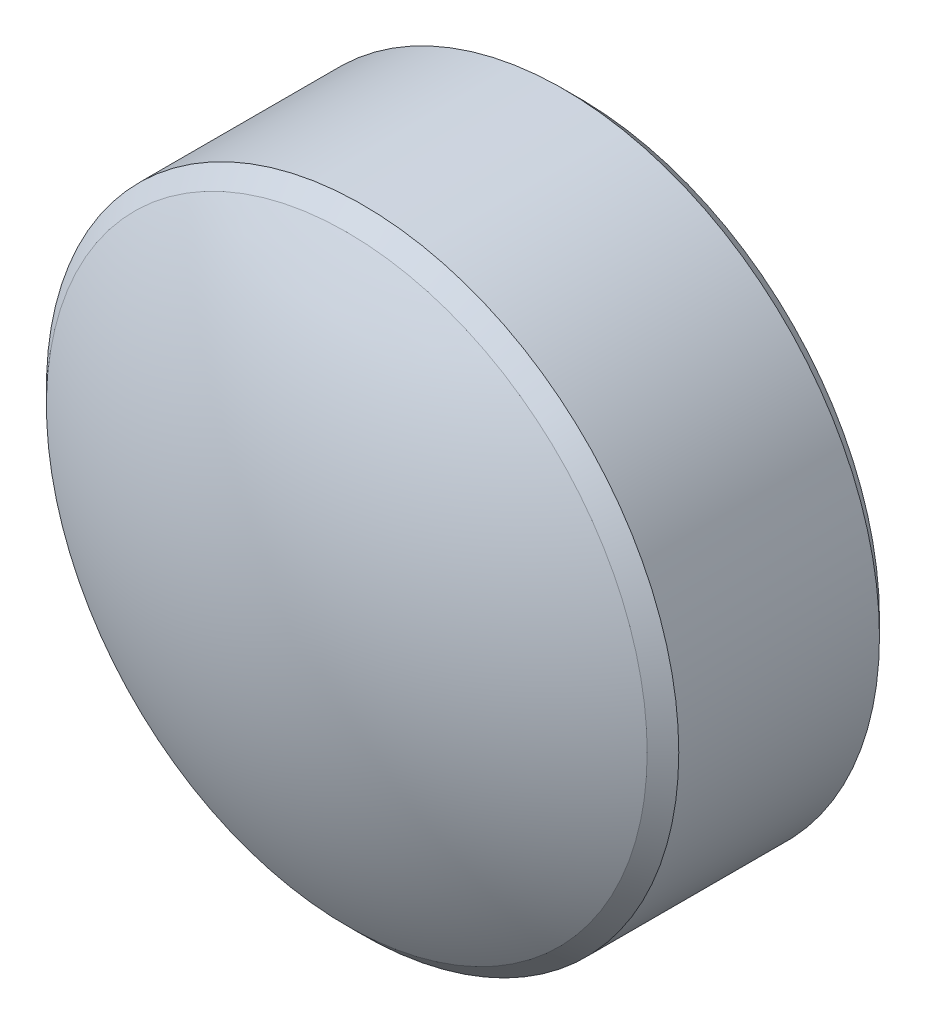
ISO-10303-21;
HEADER;
FILE_DESCRIPTION(('STEP AP214'),'2;1');
FILE_NAME('part.step','',(''),(''),'','','');
FILE_SCHEMA(('AUTOMOTIVE_DESIGN { 1 0 10303 214 1 1 1 1 }'));
ENDSEC;
DATA;
#1=APPLICATION_CONTEXT('core data for automotive mechanical design processes');
#2=APPLICATION_PROTOCOL_DEFINITION('international standard','automotive_design',2000,#1);
#3=PRODUCT_CONTEXT('',#1,'mechanical');
#4=PRODUCT('Part','Part','',(#3));
#5=PRODUCT_RELATED_PRODUCT_CATEGORY('part','',(#4));
#6=PRODUCT_DEFINITION_FORMATION('','',#4);
#7=PRODUCT_DEFINITION_CONTEXT('part definition',#1,'design');
#8=PRODUCT_DEFINITION('design','',#6,#7);
#9=PRODUCT_DEFINITION_SHAPE('','',#8);
#10=(LENGTH_UNIT() NAMED_UNIT(*) SI_UNIT(.MILLI.,.METRE.));
#11=(NAMED_UNIT(*) PLANE_ANGLE_UNIT() SI_UNIT($,.RADIAN.));
#12=(NAMED_UNIT(*) SI_UNIT($,.STERADIAN.) SOLID_ANGLE_UNIT());
#13=UNCERTAINTY_MEASURE_WITH_UNIT(LENGTH_MEASURE(1.E-05),#10,'distance_accuracy_value','');
#14=(GEOMETRIC_REPRESENTATION_CONTEXT(3) GLOBAL_UNCERTAINTY_ASSIGNED_CONTEXT((#13)) GLOBAL_UNIT_ASSIGNED_CONTEXT((#10,
#11,#12)) REPRESENTATION_CONTEXT('',''));
#15=CARTESIAN_POINT('',(0.,0.,0.));
#16=DIRECTION('',(0.,0.,1.));
#17=DIRECTION('',(1.,0.,0.));
#18=AXIS2_PLACEMENT_3D('',#15,#16,#17);
#19=CARTESIAN_POINT('',(1.06929508064816,0.968211585617952,0.916153136988532));
#20=DIRECTION('',(0.,0.,1.));
#21=DIRECTION('',(1.,0.,0.));
#22=AXIS2_PLACEMENT_3D('',#19,#20,#21);
#23=PLANE('',#22);
#24=CARTESIAN_POINT('',(1.06929508064816,0.968211585617952,0.916153136988532));
#25=DIRECTION('',(0.,0.,1.));
#26=DIRECTION('',(1.,0.,0.));
#27=AXIS2_PLACEMENT_3D('',#24,#25,#26);
#28=CIRCLE('',#27,0.95);
#29=CARTESIAN_POINT('',(2.01929508064816,0.968211585617952,0.916153136988532));
#30=VERTEX_POINT('',#29);
#31=EDGE_CURVE('E9',#30,#30,#28,.F.);
#32=ORIENTED_EDGE('',*,*,#31,.T.);
#33=EDGE_LOOP('',(#32));
#34=FACE_BOUND('',#33,.T.);
#35=ADVANCED_FACE('F13',(#34),#23,.F.);
#36=CARTESIAN_POINT('',(1.06929508064816,0.968211585617952,1.91615313698853));
#37=DIRECTION('',(0.,0.,1.));
#38=DIRECTION('',(1.,0.,0.));
#39=AXIS2_PLACEMENT_3D('',#36,#37,#38);
#40=CYLINDRICAL_SURFACE('',#39,1.);
#41=CARTESIAN_POINT('',(1.06929508064816,0.968211585617952,0.966153136988532));
#42=DIRECTION('',(0.,0.,1.));
#43=DIRECTION('',(1.,0.,0.));
#44=AXIS2_PLACEMENT_3D('',#41,#42,#43);
#45=CIRCLE('',#44,1.);
#46=CARTESIAN_POINT('',(2.06929508064816,0.968211585617952,0.966153136988532));
#47=VERTEX_POINT('',#46);
#48=EDGE_CURVE('E20',#47,#47,#45,.T.);
#49=ORIENTED_EDGE('',*,*,#48,.T.);
#50=EDGE_LOOP('',(#49));
#51=FACE_BOUND('',#50,.T.);
#52=CARTESIAN_POINT('',(1.06929508064816,0.968211585617952,1.60092845550932));
#53=DIRECTION('',(0.,0.,1.));
#54=DIRECTION('',(1.,0.,0.));
#55=AXIS2_PLACEMENT_3D('',#52,#53,#54);
#56=CIRCLE('',#55,1.);
#57=CARTESIAN_POINT('',(2.06929508064816,0.968211585617952,1.60092845550932));
#58=VERTEX_POINT('',#57);
#59=EDGE_CURVE('E24',#58,#58,#56,.T.);
#60=ORIENTED_EDGE('',*,*,#59,.F.);
#61=EDGE_LOOP('',(#60));
#62=FACE_BOUND('',#61,.T.);
#63=ADVANCED_FACE('F39',(#51,#62),#40,.T.);
#64=CARTESIAN_POINT('',(1.06929508064816,0.968211585617952,1.60092845550932));
#65=DIRECTION('',(0.,0.,-1.));
#66=DIRECTION('',(-1.,0.,0.));
#67=AXIS2_PLACEMENT_3D('',#64,#65,#66);
#68=CONICAL_SURFACE('',#67,1.,0.785398163397446);
#69=CARTESIAN_POINT('',(1.06929508064816,0.968211585617952,1.65092845550932));
#70=DIRECTION('',(0.,0.,1.));
#71=DIRECTION('',(1.,0.,0.));
#72=AXIS2_PLACEMENT_3D('',#69,#70,#71);
#73=CIRCLE('',#72,0.95);
#74=CARTESIAN_POINT('',(2.01929508064816,0.968211585617952,1.65092845550932));
#75=VERTEX_POINT('',#74);
#76=EDGE_CURVE('E28',#75,#75,#73,.T.);
#77=ORIENTED_EDGE('',*,*,#76,.F.);
#78=EDGE_LOOP('',(#77));
#79=FACE_BOUND('',#78,.T.);
#80=ORIENTED_EDGE('',*,*,#59,.T.);
#81=EDGE_LOOP('',(#80));
#82=FACE_BOUND('',#81,.T.);
#83=ADVANCED_FACE('F36',(#79,#82),#68,.T.);
#84=CARTESIAN_POINT('',(1.06929508064816,0.968211585617952,0.0821531369885322));
#85=DIRECTION('',(0.,0.,1.));
#86=DIRECTION('',(0.,1.,0.));
#87=AXIS2_PLACEMENT_3D('',#84,#85,#86);
#88=SPHERICAL_SURFACE('',#87,1.834);
#89=ORIENTED_EDGE('',*,*,#76,.T.);
#90=EDGE_LOOP('',(#89));
#91=FACE_BOUND('',#90,.T.);
#92=ADVANCED_FACE('F34',(#91),#88,.T.);
#93=CARTESIAN_POINT('',(1.06929508064816,0.968211585617952,0.966153136988532));
#94=DIRECTION('',(0.,0.,1.));
#95=DIRECTION('',(1.,0.,0.));
#96=AXIS2_PLACEMENT_3D('',#93,#94,#95);
#97=CONICAL_SURFACE('',#96,1.,0.785398163397444);
#98=ORIENTED_EDGE('',*,*,#31,.F.);
#99=EDGE_LOOP('',(#98));
#100=FACE_BOUND('',#99,.T.);
#101=ORIENTED_EDGE('',*,*,#48,.F.);
#102=EDGE_LOOP('',(#101));
#103=FACE_BOUND('',#102,.T.);
#104=ADVANCED_FACE('F15',(#100,#103),#97,.T.);
#105=CLOSED_SHELL('',(#35,#63,#83,#92,#104));
#106=MANIFOLD_SOLID_BREP('B1',#105);
#107=ADVANCED_BREP_SHAPE_REPRESENTATION('',(#18,#106),#14);
#108=SHAPE_DEFINITION_REPRESENTATION(#9,#107);
ENDSEC;
END-ISO-10303-21;
